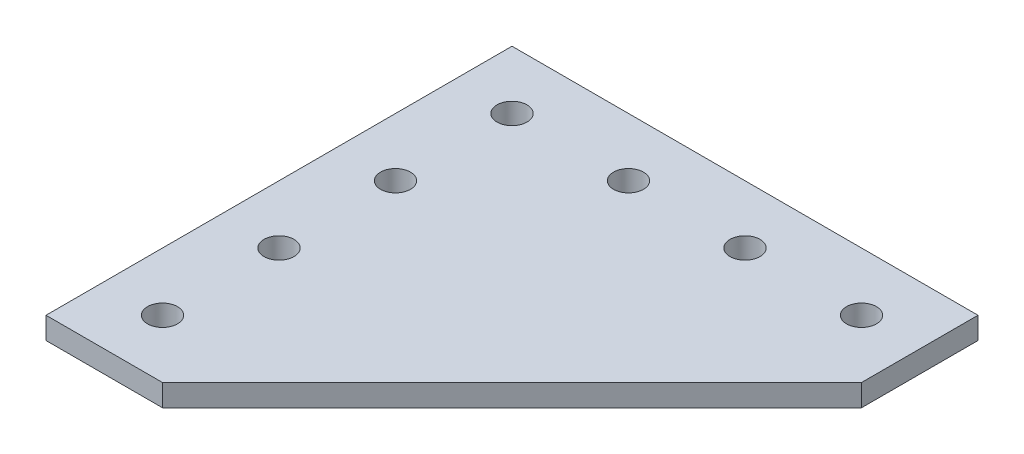
ISO-10303-21;
HEADER;
FILE_DESCRIPTION(('STEP AP214'),'2;1');
FILE_NAME('part.step','',(''),(''),'','','');
FILE_SCHEMA(('AUTOMOTIVE_DESIGN { 1 0 10303 214 1 1 1 1 }'));
ENDSEC;
DATA;
#1=APPLICATION_CONTEXT('core data for automotive mechanical design processes');
#2=APPLICATION_PROTOCOL_DEFINITION('international standard','automotive_design',2000,#1);
#3=PRODUCT_CONTEXT('',#1,'mechanical');
#4=PRODUCT('Part','Part','',(#3));
#5=PRODUCT_RELATED_PRODUCT_CATEGORY('part','',(#4));
#6=PRODUCT_DEFINITION_FORMATION('','',#4);
#7=PRODUCT_DEFINITION_CONTEXT('part definition',#1,'design');
#8=PRODUCT_DEFINITION('design','',#6,#7);
#9=PRODUCT_DEFINITION_SHAPE('','',#8);
#10=(LENGTH_UNIT() NAMED_UNIT(*) SI_UNIT(.MILLI.,.METRE.));
#11=(NAMED_UNIT(*) PLANE_ANGLE_UNIT() SI_UNIT($,.RADIAN.));
#12=(NAMED_UNIT(*) SI_UNIT($,.STERADIAN.) SOLID_ANGLE_UNIT());
#13=UNCERTAINTY_MEASURE_WITH_UNIT(LENGTH_MEASURE(1.E-05),#10,'distance_accuracy_value','');
#14=(GEOMETRIC_REPRESENTATION_CONTEXT(3) GLOBAL_UNCERTAINTY_ASSIGNED_CONTEXT((#13)) GLOBAL_UNIT_ASSIGNED_CONTEXT((#10,
#11,#12)) REPRESENTATION_CONTEXT('',''));
#15=CARTESIAN_POINT('',(0.,0.,0.));
#16=DIRECTION('',(0.,0.,1.));
#17=DIRECTION('',(1.,0.,0.));
#18=AXIS2_PLACEMENT_3D('',#15,#16,#17);
#19=CARTESIAN_POINT('',(0.,-4.77520000000001,25.4));
#20=DIRECTION('',(1.,0.,0.));
#21=DIRECTION('',(0.,0.,-1.));
#22=AXIS2_PLACEMENT_3D('',#19,#20,#21);
#23=PLANE('',#22);
#24=DIRECTION('',(0.,0.,-1.));
#25=VECTOR('',#24,1.);
#26=CARTESIAN_POINT('',(0.,0.,25.4));
#27=LINE('',#26,#25);
#28=CARTESIAN_POINT('',(0.,0.,25.4));
#29=VERTEX_POINT('',#28);
#30=CARTESIAN_POINT('',(0.,0.,0.));
#31=VERTEX_POINT('',#30);
#32=EDGE_CURVE('E109',#29,#31,#27,.T.);
#33=ORIENTED_EDGE('',*,*,#32,.F.);
#34=DIRECTION('',(0.,1.,0.));
#35=VECTOR('',#34,1.);
#36=CARTESIAN_POINT('',(0.,-4.77520000000001,25.4));
#37=LINE('',#36,#35);
#38=CARTESIAN_POINT('',(0.,-4.77520000000001,25.4));
#39=VERTEX_POINT('',#38);
#40=EDGE_CURVE('E11',#39,#29,#37,.T.);
#41=ORIENTED_EDGE('',*,*,#40,.F.);
#42=DIRECTION('',(0.,0.,-1.));
#43=VECTOR('',#42,1.);
#44=CARTESIAN_POINT('',(0.,-4.77520000000001,25.4));
#45=LINE('',#44,#43);
#46=CARTESIAN_POINT('',(0.,-4.77520000000001,0.));
#47=VERTEX_POINT('',#46);
#48=EDGE_CURVE('E104',#39,#47,#45,.T.);
#49=ORIENTED_EDGE('',*,*,#48,.T.);
#50=DIRECTION('',(0.,1.,0.));
#51=VECTOR('',#50,1.);
#52=CARTESIAN_POINT('',(0.,-4.77520000000001,0.));
#53=LINE('',#52,#51);
#54=EDGE_CURVE('E35',#47,#31,#53,.T.);
#55=ORIENTED_EDGE('',*,*,#54,.T.);
#56=EDGE_LOOP('',(#33,#41,#49,#55));
#57=FACE_BOUND('',#56,.T.);
#58=ADVANCED_FACE('F32',(#57),#23,.T.);
#59=CARTESIAN_POINT('',(-76.2,-4.77520000000001,101.6));
#60=DIRECTION('',(0.707106781186547,0.,0.707106781186548));
#61=DIRECTION('',(0.707106781186548,0.,-0.707106781186547));
#62=AXIS2_PLACEMENT_3D('',#59,#60,#61);
#63=PLANE('',#62);
#64=DIRECTION('',(0.707106781186548,0.,-0.707106781186547));
#65=VECTOR('',#64,1.);
#66=CARTESIAN_POINT('',(-76.2,0.,101.6));
#67=LINE('',#66,#65);
#68=CARTESIAN_POINT('',(-76.2,0.,101.6));
#69=VERTEX_POINT('',#68);
#70=EDGE_CURVE('E119',#69,#29,#67,.T.);
#71=ORIENTED_EDGE('',*,*,#70,.F.);
#72=DIRECTION('',(0.,1.,0.));
#73=VECTOR('',#72,1.);
#74=CARTESIAN_POINT('',(-76.2,-4.77520000000001,101.6));
#75=LINE('',#74,#73);
#76=CARTESIAN_POINT('',(-76.2,-4.77520000000001,101.6));
#77=VERTEX_POINT('',#76);
#78=EDGE_CURVE('E41',#77,#69,#75,.T.);
#79=ORIENTED_EDGE('',*,*,#78,.F.);
#80=DIRECTION('',(0.707106781186548,0.,-0.707106781186547));
#81=VECTOR('',#80,1.);
#82=CARTESIAN_POINT('',(-76.2,-4.77520000000001,101.6));
#83=LINE('',#82,#81);
#84=EDGE_CURVE('E99',#77,#39,#83,.T.);
#85=ORIENTED_EDGE('',*,*,#84,.T.);
#86=ORIENTED_EDGE('',*,*,#40,.T.);
#87=EDGE_LOOP('',(#71,#79,#85,#86));
#88=FACE_BOUND('',#87,.T.);
#89=ADVANCED_FACE('F125',(#88),#63,.T.);
#90=CARTESIAN_POINT('',(-101.6,-4.77520000000001,101.6));
#91=DIRECTION('',(0.,0.,1.));
#92=DIRECTION('',(1.,0.,0.));
#93=AXIS2_PLACEMENT_3D('',#90,#91,#92);
#94=PLANE('',#93);
#95=DIRECTION('',(1.,0.,0.));
#96=VECTOR('',#95,1.);
#97=CARTESIAN_POINT('',(-101.6,0.,101.6));
#98=LINE('',#97,#96);
#99=CARTESIAN_POINT('',(-101.6,0.,101.6));
#100=VERTEX_POINT('',#99);
#101=EDGE_CURVE('E88',#100,#69,#98,.T.);
#102=ORIENTED_EDGE('',*,*,#101,.F.);
#103=DIRECTION('',(0.,1.,0.));
#104=VECTOR('',#103,1.);
#105=CARTESIAN_POINT('',(-101.6,-4.77520000000001,101.6));
#106=LINE('',#105,#104);
#107=CARTESIAN_POINT('',(-101.6,-4.77520000000001,101.6));
#108=VERTEX_POINT('',#107);
#109=EDGE_CURVE('E83',#108,#100,#106,.T.);
#110=ORIENTED_EDGE('',*,*,#109,.F.);
#111=DIRECTION('',(1.,0.,0.));
#112=VECTOR('',#111,1.);
#113=CARTESIAN_POINT('',(-101.6,-4.77520000000001,101.6));
#114=LINE('',#113,#112);
#115=EDGE_CURVE('E86',#108,#77,#114,.T.);
#116=ORIENTED_EDGE('',*,*,#115,.T.);
#117=ORIENTED_EDGE('',*,*,#78,.T.);
#118=EDGE_LOOP('',(#102,#110,#116,#117));
#119=FACE_BOUND('',#118,.T.);
#120=ADVANCED_FACE('F85',(#119),#94,.T.);
#121=CARTESIAN_POINT('',(-101.6,-4.77520000000001,0.));
#122=DIRECTION('',(-1.,0.,0.));
#123=DIRECTION('',(0.,0.,1.));
#124=AXIS2_PLACEMENT_3D('',#121,#122,#123);
#125=PLANE('',#124);
#126=DIRECTION('',(0.,0.,1.));
#127=VECTOR('',#126,1.);
#128=CARTESIAN_POINT('',(-101.6,0.,0.));
#129=LINE('',#128,#127);
#130=CARTESIAN_POINT('',(-101.6,0.,0.));
#131=VERTEX_POINT('',#130);
#132=EDGE_CURVE('E116',#131,#100,#129,.T.);
#133=ORIENTED_EDGE('',*,*,#132,.F.);
#134=DIRECTION('',(0.,1.,0.));
#135=VECTOR('',#134,1.);
#136=CARTESIAN_POINT('',(-101.6,-4.77520000000001,0.));
#137=LINE('',#136,#135);
#138=CARTESIAN_POINT('',(-101.6,-4.77520000000001,0.));
#139=VERTEX_POINT('',#138);
#140=EDGE_CURVE('E93',#139,#131,#137,.T.);
#141=ORIENTED_EDGE('',*,*,#140,.F.);
#142=DIRECTION('',(0.,0.,1.));
#143=VECTOR('',#142,1.);
#144=CARTESIAN_POINT('',(-101.6,-4.77520000000001,0.));
#145=LINE('',#144,#143);
#146=EDGE_CURVE('E98',#139,#108,#145,.T.);
#147=ORIENTED_EDGE('',*,*,#146,.T.);
#148=ORIENTED_EDGE('',*,*,#109,.T.);
#149=EDGE_LOOP('',(#133,#141,#147,#148));
#150=FACE_BOUND('',#149,.T.);
#151=ADVANCED_FACE('F101',(#150),#125,.T.);
#152=CARTESIAN_POINT('',(0.,-4.77520000000001,0.));
#153=DIRECTION('',(0.,0.,-1.));
#154=DIRECTION('',(-1.,0.,0.));
#155=AXIS2_PLACEMENT_3D('',#152,#153,#154);
#156=PLANE('',#155);
#157=DIRECTION('',(-1.,0.,0.));
#158=VECTOR('',#157,1.);
#159=CARTESIAN_POINT('',(0.,0.,0.));
#160=LINE('',#159,#158);
#161=EDGE_CURVE('E112',#31,#131,#160,.T.);
#162=ORIENTED_EDGE('',*,*,#161,.F.);
#163=ORIENTED_EDGE('',*,*,#54,.F.);
#164=DIRECTION('',(-1.,0.,0.));
#165=VECTOR('',#164,1.);
#166=CARTESIAN_POINT('',(0.,-4.77520000000001,0.));
#167=LINE('',#166,#165);
#168=EDGE_CURVE('E102',#47,#139,#167,.T.);
#169=ORIENTED_EDGE('',*,*,#168,.T.);
#170=ORIENTED_EDGE('',*,*,#140,.T.);
#171=EDGE_LOOP('',(#162,#163,#169,#170));
#172=FACE_BOUND('',#171,.T.);
#173=ADVANCED_FACE('F122',(#172),#156,.T.);
#174=CARTESIAN_POINT('',(0.,-4.77520000000001,0.));
#175=DIRECTION('',(0.,1.,0.));
#176=DIRECTION('',(0.,0.,1.));
#177=AXIS2_PLACEMENT_3D('',#174,#175,#176);
#178=PLANE('',#177);
#179=CARTESIAN_POINT('',(-12.7,-4.77520000000001,12.7));
#180=DIRECTION('',(0.,1.,0.));
#181=DIRECTION('',(0.,0.,-1.));
#182=AXIS2_PLACEMENT_3D('',#179,#180,#181);
#183=CIRCLE('',#182,3.2639);
#184=CARTESIAN_POINT('',(-12.7,-4.77520000000001,9.4361));
#185=VERTEX_POINT('',#184);
#186=EDGE_CURVE('E180',#185,#185,#183,.T.);
#187=ORIENTED_EDGE('',*,*,#186,.T.);
#188=EDGE_LOOP('',(#187));
#189=FACE_BOUND('',#188,.T.);
#190=CARTESIAN_POINT('',(-88.9,-4.77520000000001,38.1));
#191=DIRECTION('',(0.,1.,0.));
#192=DIRECTION('',(0.,0.,-1.));
#193=AXIS2_PLACEMENT_3D('',#190,#191,#192);
#194=CIRCLE('',#193,3.2639);
#195=CARTESIAN_POINT('',(-88.9,-4.77520000000001,34.8361));
#196=VERTEX_POINT('',#195);
#197=EDGE_CURVE('E188',#196,#196,#194,.T.);
#198=ORIENTED_EDGE('',*,*,#197,.T.);
#199=EDGE_LOOP('',(#198));
#200=FACE_BOUND('',#199,.T.);
#201=CARTESIAN_POINT('',(-88.9,-4.77520000000001,12.7));
#202=DIRECTION('',(0.,1.,0.));
#203=DIRECTION('',(0.,0.,-1.));
#204=AXIS2_PLACEMENT_3D('',#201,#202,#203);
#205=CIRCLE('',#204,3.2639);
#206=CARTESIAN_POINT('',(-88.9,-4.77520000000001,9.43610000000003));
#207=VERTEX_POINT('',#206);
#208=EDGE_CURVE('E194',#207,#207,#205,.T.);
#209=ORIENTED_EDGE('',*,*,#208,.T.);
#210=EDGE_LOOP('',(#209));
#211=FACE_BOUND('',#210,.T.);
#212=CARTESIAN_POINT('',(-63.5,-4.77520000000001,12.7));
#213=DIRECTION('',(0.,1.,0.));
#214=DIRECTION('',(0.,0.,-1.));
#215=AXIS2_PLACEMENT_3D('',#212,#213,#214);
#216=CIRCLE('',#215,3.2639);
#217=CARTESIAN_POINT('',(-63.5,-4.77520000000001,9.43610000000002));
#218=VERTEX_POINT('',#217);
#219=EDGE_CURVE('E200',#218,#218,#216,.T.);
#220=ORIENTED_EDGE('',*,*,#219,.T.);
#221=EDGE_LOOP('',(#220));
#222=FACE_BOUND('',#221,.T.);
#223=CARTESIAN_POINT('',(-38.1,-4.77520000000001,12.7));
#224=DIRECTION('',(0.,1.,0.));
#225=DIRECTION('',(0.,0.,-1.));
#226=AXIS2_PLACEMENT_3D('',#223,#224,#225);
#227=CIRCLE('',#226,3.2639);
#228=CARTESIAN_POINT('',(-38.1,-4.77520000000001,9.4361));
#229=VERTEX_POINT('',#228);
#230=EDGE_CURVE('E206',#229,#229,#227,.T.);
#231=ORIENTED_EDGE('',*,*,#230,.T.);
#232=EDGE_LOOP('',(#231));
#233=FACE_BOUND('',#232,.T.);
#234=CARTESIAN_POINT('',(-88.9,-4.77520000000001,63.5));
#235=DIRECTION('',(0.,1.,0.));
#236=DIRECTION('',(0.,0.,-1.));
#237=AXIS2_PLACEMENT_3D('',#234,#235,#236);
#238=CIRCLE('',#237,3.2639);
#239=CARTESIAN_POINT('',(-88.9,-4.77520000000001,60.2361));
#240=VERTEX_POINT('',#239);
#241=EDGE_CURVE('E212',#240,#240,#238,.T.);
#242=ORIENTED_EDGE('',*,*,#241,.T.);
#243=EDGE_LOOP('',(#242));
#244=FACE_BOUND('',#243,.T.);
#245=CARTESIAN_POINT('',(-88.9,-4.77520000000001,88.9));
#246=DIRECTION('',(0.,1.,0.));
#247=DIRECTION('',(0.,0.,-1.));
#248=AXIS2_PLACEMENT_3D('',#245,#246,#247);
#249=CIRCLE('',#248,3.2639);
#250=CARTESIAN_POINT('',(-88.9,-4.77520000000001,85.6361));
#251=VERTEX_POINT('',#250);
#252=EDGE_CURVE('E113',#251,#251,#249,.T.);
#253=ORIENTED_EDGE('',*,*,#252,.T.);
#254=EDGE_LOOP('',(#253));
#255=FACE_BOUND('',#254,.T.);
#256=ORIENTED_EDGE('',*,*,#48,.F.);
#257=ORIENTED_EDGE('',*,*,#84,.F.);
#258=ORIENTED_EDGE('',*,*,#115,.F.);
#259=ORIENTED_EDGE('',*,*,#146,.F.);
#260=ORIENTED_EDGE('',*,*,#168,.F.);
#261=EDGE_LOOP('',(#256,#257,#258,#259,#260));
#262=FACE_BOUND('',#261,.T.);
#263=ADVANCED_FACE('F97',(#189,#200,#211,#222,#233,#244,#255,#262),#178,.F.);
#264=CARTESIAN_POINT('',(0.,0.,0.));
#265=DIRECTION('',(0.,1.,0.));
#266=DIRECTION('',(0.,0.,1.));
#267=AXIS2_PLACEMENT_3D('',#264,#265,#266);
#268=PLANE('',#267);
#269=CARTESIAN_POINT('',(-12.7,0.,12.7));
#270=DIRECTION('',(0.,1.,0.));
#271=DIRECTION('',(0.,0.,-1.));
#272=AXIS2_PLACEMENT_3D('',#269,#270,#271);
#273=CIRCLE('',#272,3.2639);
#274=CARTESIAN_POINT('',(-12.7,0.,9.4361));
#275=VERTEX_POINT('',#274);
#276=EDGE_CURVE('E183',#275,#275,#273,.T.);
#277=ORIENTED_EDGE('',*,*,#276,.F.);
#278=EDGE_LOOP('',(#277));
#279=FACE_BOUND('',#278,.T.);
#280=CARTESIAN_POINT('',(-88.9,0.,38.1));
#281=DIRECTION('',(0.,1.,0.));
#282=DIRECTION('',(0.,0.,-1.));
#283=AXIS2_PLACEMENT_3D('',#280,#281,#282);
#284=CIRCLE('',#283,3.2639);
#285=CARTESIAN_POINT('',(-88.9,0.,34.8361));
#286=VERTEX_POINT('',#285);
#287=EDGE_CURVE('E185',#286,#286,#284,.T.);
#288=ORIENTED_EDGE('',*,*,#287,.F.);
#289=EDGE_LOOP('',(#288));
#290=FACE_BOUND('',#289,.T.);
#291=CARTESIAN_POINT('',(-88.9,0.,12.7));
#292=DIRECTION('',(0.,1.,0.));
#293=DIRECTION('',(0.,0.,-1.));
#294=AXIS2_PLACEMENT_3D('',#291,#292,#293);
#295=CIRCLE('',#294,3.2639);
#296=CARTESIAN_POINT('',(-88.9,0.,9.43610000000003));
#297=VERTEX_POINT('',#296);
#298=EDGE_CURVE('E191',#297,#297,#295,.T.);
#299=ORIENTED_EDGE('',*,*,#298,.F.);
#300=EDGE_LOOP('',(#299));
#301=FACE_BOUND('',#300,.T.);
#302=CARTESIAN_POINT('',(-63.5,0.,12.7));
#303=DIRECTION('',(0.,1.,0.));
#304=DIRECTION('',(0.,0.,-1.));
#305=AXIS2_PLACEMENT_3D('',#302,#303,#304);
#306=CIRCLE('',#305,3.2639);
#307=CARTESIAN_POINT('',(-63.5,0.,9.43610000000002));
#308=VERTEX_POINT('',#307);
#309=EDGE_CURVE('E197',#308,#308,#306,.T.);
#310=ORIENTED_EDGE('',*,*,#309,.F.);
#311=EDGE_LOOP('',(#310));
#312=FACE_BOUND('',#311,.T.);
#313=CARTESIAN_POINT('',(-38.1,0.,12.7));
#314=DIRECTION('',(0.,1.,0.));
#315=DIRECTION('',(0.,0.,-1.));
#316=AXIS2_PLACEMENT_3D('',#313,#314,#315);
#317=CIRCLE('',#316,3.2639);
#318=CARTESIAN_POINT('',(-38.1,0.,9.4361));
#319=VERTEX_POINT('',#318);
#320=EDGE_CURVE('E203',#319,#319,#317,.T.);
#321=ORIENTED_EDGE('',*,*,#320,.F.);
#322=EDGE_LOOP('',(#321));
#323=FACE_BOUND('',#322,.T.);
#324=CARTESIAN_POINT('',(-88.9,0.,63.5));
#325=DIRECTION('',(0.,1.,0.));
#326=DIRECTION('',(0.,0.,-1.));
#327=AXIS2_PLACEMENT_3D('',#324,#325,#326);
#328=CIRCLE('',#327,3.2639);
#329=CARTESIAN_POINT('',(-88.9,0.,60.2361));
#330=VERTEX_POINT('',#329);
#331=EDGE_CURVE('E209',#330,#330,#328,.T.);
#332=ORIENTED_EDGE('',*,*,#331,.F.);
#333=EDGE_LOOP('',(#332));
#334=FACE_BOUND('',#333,.T.);
#335=CARTESIAN_POINT('',(-88.9,0.,88.9));
#336=DIRECTION('',(0.,1.,0.));
#337=DIRECTION('',(0.,0.,-1.));
#338=AXIS2_PLACEMENT_3D('',#335,#336,#337);
#339=CIRCLE('',#338,3.2639);
#340=CARTESIAN_POINT('',(-88.9,0.,85.6361));
#341=VERTEX_POINT('',#340);
#342=EDGE_CURVE('E215',#341,#341,#339,.T.);
#343=ORIENTED_EDGE('',*,*,#342,.F.);
#344=EDGE_LOOP('',(#343));
#345=FACE_BOUND('',#344,.T.);
#346=ORIENTED_EDGE('',*,*,#32,.T.);
#347=ORIENTED_EDGE('',*,*,#161,.T.);
#348=ORIENTED_EDGE('',*,*,#132,.T.);
#349=ORIENTED_EDGE('',*,*,#101,.T.);
#350=ORIENTED_EDGE('',*,*,#70,.T.);
#351=EDGE_LOOP('',(#346,#347,#348,#349,#350));
#352=FACE_BOUND('',#351,.T.);
#353=ADVANCED_FACE('F124',(#279,#290,#301,#312,#323,#334,#345,#352),#268,.T.);
#354=CARTESIAN_POINT('',(-88.9,-4.77520000000001,88.9));
#355=DIRECTION('',(0.,1.,0.));
#356=DIRECTION('',(0.,0.,1.));
#357=AXIS2_PLACEMENT_3D('',#354,#355,#356);
#358=CYLINDRICAL_SURFACE('',#357,3.2639);
#359=ORIENTED_EDGE('',*,*,#252,.F.);
#360=EDGE_LOOP('',(#359));
#361=FACE_BOUND('',#360,.T.);
#362=ORIENTED_EDGE('',*,*,#342,.T.);
#363=EDGE_LOOP('',(#362));
#364=FACE_BOUND('',#363,.T.);
#365=ADVANCED_FACE('F145',(#361,#364),#358,.F.);
#366=CARTESIAN_POINT('',(-88.9,-4.77520000000001,63.5));
#367=DIRECTION('',(0.,1.,0.));
#368=DIRECTION('',(0.,0.,1.));
#369=AXIS2_PLACEMENT_3D('',#366,#367,#368);
#370=CYLINDRICAL_SURFACE('',#369,3.2639);
#371=ORIENTED_EDGE('',*,*,#241,.F.);
#372=EDGE_LOOP('',(#371));
#373=FACE_BOUND('',#372,.T.);
#374=ORIENTED_EDGE('',*,*,#331,.T.);
#375=EDGE_LOOP('',(#374));
#376=FACE_BOUND('',#375,.T.);
#377=ADVANCED_FACE('F152',(#373,#376),#370,.F.);
#378=CARTESIAN_POINT('',(-38.1,-4.77520000000001,12.7));
#379=DIRECTION('',(0.,1.,0.));
#380=DIRECTION('',(0.,0.,1.));
#381=AXIS2_PLACEMENT_3D('',#378,#379,#380);
#382=CYLINDRICAL_SURFACE('',#381,3.2639);
#383=ORIENTED_EDGE('',*,*,#230,.F.);
#384=EDGE_LOOP('',(#383));
#385=FACE_BOUND('',#384,.T.);
#386=ORIENTED_EDGE('',*,*,#320,.T.);
#387=EDGE_LOOP('',(#386));
#388=FACE_BOUND('',#387,.T.);
#389=ADVANCED_FACE('F156',(#385,#388),#382,.F.);
#390=CARTESIAN_POINT('',(-63.5,-4.77520000000001,12.7));
#391=DIRECTION('',(0.,1.,0.));
#392=DIRECTION('',(0.,0.,1.));
#393=AXIS2_PLACEMENT_3D('',#390,#391,#392);
#394=CYLINDRICAL_SURFACE('',#393,3.2639);
#395=ORIENTED_EDGE('',*,*,#219,.F.);
#396=EDGE_LOOP('',(#395));
#397=FACE_BOUND('',#396,.T.);
#398=ORIENTED_EDGE('',*,*,#309,.T.);
#399=EDGE_LOOP('',(#398));
#400=FACE_BOUND('',#399,.T.);
#401=ADVANCED_FACE('F160',(#397,#400),#394,.F.);
#402=CARTESIAN_POINT('',(-88.9,-4.77520000000001,12.7));
#403=DIRECTION('',(0.,1.,0.));
#404=DIRECTION('',(0.,0.,1.));
#405=AXIS2_PLACEMENT_3D('',#402,#403,#404);
#406=CYLINDRICAL_SURFACE('',#405,3.2639);
#407=ORIENTED_EDGE('',*,*,#208,.F.);
#408=EDGE_LOOP('',(#407));
#409=FACE_BOUND('',#408,.T.);
#410=ORIENTED_EDGE('',*,*,#298,.T.);
#411=EDGE_LOOP('',(#410));
#412=FACE_BOUND('',#411,.T.);
#413=ADVANCED_FACE('F164',(#409,#412),#406,.F.);
#414=CARTESIAN_POINT('',(-88.9,-4.77520000000001,38.1));
#415=DIRECTION('',(0.,1.,0.));
#416=DIRECTION('',(0.,0.,1.));
#417=AXIS2_PLACEMENT_3D('',#414,#415,#416);
#418=CYLINDRICAL_SURFACE('',#417,3.2639);
#419=ORIENTED_EDGE('',*,*,#197,.F.);
#420=EDGE_LOOP('',(#419));
#421=FACE_BOUND('',#420,.T.);
#422=ORIENTED_EDGE('',*,*,#287,.T.);
#423=EDGE_LOOP('',(#422));
#424=FACE_BOUND('',#423,.T.);
#425=ADVANCED_FACE('F168',(#421,#424),#418,.F.);
#426=CARTESIAN_POINT('',(-12.7,-4.77520000000001,12.7));
#427=DIRECTION('',(0.,1.,0.));
#428=DIRECTION('',(0.,0.,1.));
#429=AXIS2_PLACEMENT_3D('',#426,#427,#428);
#430=CYLINDRICAL_SURFACE('',#429,3.2639);
#431=ORIENTED_EDGE('',*,*,#186,.F.);
#432=EDGE_LOOP('',(#431));
#433=FACE_BOUND('',#432,.T.);
#434=ORIENTED_EDGE('',*,*,#276,.T.);
#435=EDGE_LOOP('',(#434));
#436=FACE_BOUND('',#435,.T.);
#437=ADVANCED_FACE('F172',(#433,#436),#430,.F.);
#438=CLOSED_SHELL('',(#58,#89,#120,#151,#173,#263,#353,#365,#377,#389,#401,#413,#425,#437));
#439=MANIFOLD_SOLID_BREP('B2',#438);
#440=ADVANCED_BREP_SHAPE_REPRESENTATION('',(#18,#439),#14);
#441=SHAPE_DEFINITION_REPRESENTATION(#9,#440);
ENDSEC;
END-ISO-10303-21;
